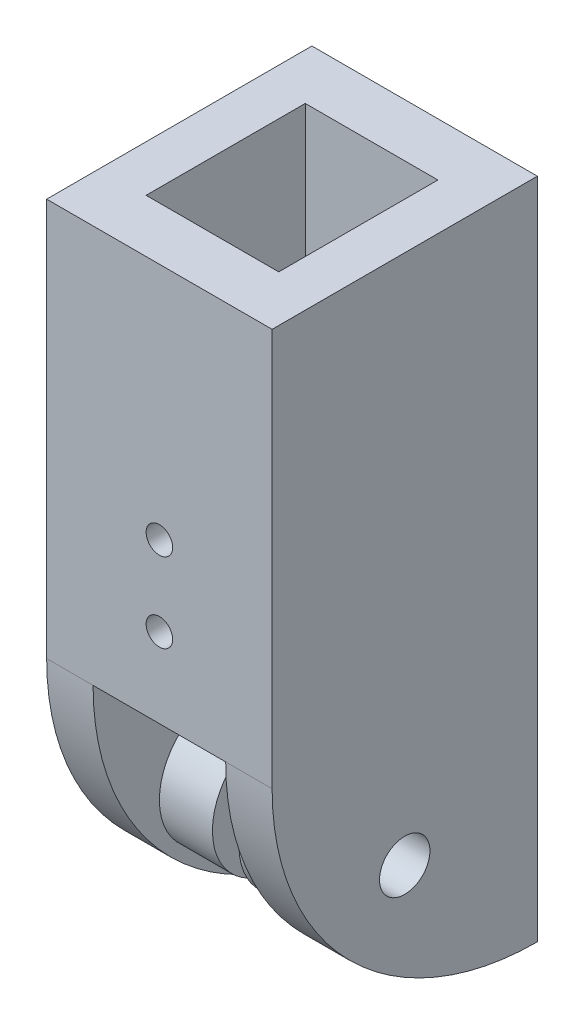
ISO-10303-21;
HEADER;
FILE_DESCRIPTION(('STEP AP214'),'2;1');
FILE_NAME('part.step','',(''),(''),'','','');
FILE_SCHEMA(('AUTOMOTIVE_DESIGN { 1 0 10303 214 1 1 1 1 }'));
ENDSEC;
DATA;
#1=APPLICATION_CONTEXT('core data for automotive mechanical design processes');
#2=APPLICATION_PROTOCOL_DEFINITION('international standard','automotive_design',2000,#1);
#3=PRODUCT_CONTEXT('',#1,'mechanical');
#4=PRODUCT('Part','Part','',(#3));
#5=PRODUCT_RELATED_PRODUCT_CATEGORY('part','',(#4));
#6=PRODUCT_DEFINITION_FORMATION('','',#4);
#7=PRODUCT_DEFINITION_CONTEXT('part definition',#1,'design');
#8=PRODUCT_DEFINITION('design','',#6,#7);
#9=PRODUCT_DEFINITION_SHAPE('','',#8);
#10=(LENGTH_UNIT() NAMED_UNIT(*) SI_UNIT(.MILLI.,.METRE.));
#11=(NAMED_UNIT(*) PLANE_ANGLE_UNIT() SI_UNIT($,.RADIAN.));
#12=(NAMED_UNIT(*) SI_UNIT($,.STERADIAN.) SOLID_ANGLE_UNIT());
#13=UNCERTAINTY_MEASURE_WITH_UNIT(LENGTH_MEASURE(1.E-05),#10,'distance_accuracy_value','');
#14=(GEOMETRIC_REPRESENTATION_CONTEXT(3) GLOBAL_UNCERTAINTY_ASSIGNED_CONTEXT((#13)) GLOBAL_UNIT_ASSIGNED_CONTEXT((#10,
#11,#12)) REPRESENTATION_CONTEXT('',''));
#15=CARTESIAN_POINT('',(0.,0.,0.));
#16=DIRECTION('',(0.,0.,1.));
#17=DIRECTION('',(1.,0.,0.));
#18=AXIS2_PLACEMENT_3D('',#15,#16,#17);
#19=CARTESIAN_POINT('',(2.5,15.,3.));
#20=DIRECTION('',(-1.,0.,0.));
#21=DIRECTION('',(0.,0.,1.));
#22=AXIS2_PLACEMENT_3D('',#19,#20,#21);
#23=PLANE('',#22);
#24=DIRECTION('',(0.,-1.,0.));
#25=VECTOR('',#24,1.);
#26=CARTESIAN_POINT('',(2.5,15.,-3.));
#27=LINE('',#26,#25);
#28=CARTESIAN_POINT('',(2.5,15.,-3.));
#29=VERTEX_POINT('',#28);
#30=CARTESIAN_POINT('',(2.5,0.,-3.));
#31=VERTEX_POINT('',#30);
#32=EDGE_CURVE('E158',#29,#31,#27,.T.);
#33=ORIENTED_EDGE('',*,*,#32,.T.);
#34=DIRECTION('',(0.,0.,-1.));
#35=VECTOR('',#34,1.);
#36=CARTESIAN_POINT('',(2.5,0.,0.));
#37=LINE('',#36,#35);
#38=CARTESIAN_POINT('',(2.5,0.,-5.));
#39=VERTEX_POINT('',#38);
#40=EDGE_CURVE('E50',#31,#39,#37,.T.);
#41=ORIENTED_EDGE('',*,*,#40,.T.);
#42=DIRECTION('',(0.,-1.,0.));
#43=VECTOR('',#42,1.);
#44=CARTESIAN_POINT('',(2.5,0.,-5.));
#45=LINE('',#44,#43);
#46=CARTESIAN_POINT('',(2.5,-10.,-5.));
#47=VERTEX_POINT('',#46);
#48=EDGE_CURVE('E239',#39,#47,#45,.T.);
#49=ORIENTED_EDGE('',*,*,#48,.T.);
#50=CARTESIAN_POINT('',(2.5,0.,-5.));
#51=DIRECTION('',(1.,0.,0.));
#52=DIRECTION('',(0.,0.,-1.));
#53=AXIS2_PLACEMENT_3D('',#50,#51,#52);
#54=CIRCLE('',#53,10.);
#55=CARTESIAN_POINT('',(2.5,0.,5.));
#56=VERTEX_POINT('',#55);
#57=EDGE_CURVE('E235',#56,#47,#54,.T.);
#58=ORIENTED_EDGE('',*,*,#57,.F.);
#59=CARTESIAN_POINT('',(2.5,0.,3.));
#60=VERTEX_POINT('',#59);
#61=EDGE_CURVE('E231',#56,#60,#37,.T.);
#62=ORIENTED_EDGE('',*,*,#61,.T.);
#63=DIRECTION('',(0.,-1.,0.));
#64=VECTOR('',#63,1.);
#65=CARTESIAN_POINT('',(2.5,15.,3.));
#66=LINE('',#65,#64);
#67=CARTESIAN_POINT('',(2.5,15.,3.));
#68=VERTEX_POINT('',#67);
#69=EDGE_CURVE('E264',#68,#60,#66,.T.);
#70=ORIENTED_EDGE('',*,*,#69,.F.);
#71=DIRECTION('',(0.,0.,-1.));
#72=VECTOR('',#71,1.);
#73=CARTESIAN_POINT('',(2.5,15.,3.));
#74=LINE('',#73,#72);
#75=EDGE_CURVE('E250',#68,#29,#74,.T.);
#76=ORIENTED_EDGE('',*,*,#75,.T.);
#77=EDGE_LOOP('',(#33,#41,#49,#58,#62,#70,#76));
#78=FACE_BOUND('',#77,.T.);
#79=CARTESIAN_POINT('',(2.5,-5.,0.));
#80=DIRECTION('',(-1.,0.,0.));
#81=DIRECTION('',(0.,0.,1.));
#82=AXIS2_PLACEMENT_3D('',#79,#80,#81);
#83=CIRCLE('',#82,2.5);
#84=CARTESIAN_POINT('',(2.5,-5.,2.5));
#85=VERTEX_POINT('',#84);
#86=EDGE_CURVE('E424',#85,#85,#83,.T.);
#87=ORIENTED_EDGE('',*,*,#86,.F.);
#88=EDGE_LOOP('',(#87));
#89=FACE_BOUND('',#88,.T.);
#90=ADVANCED_FACE('F41',(#78,#89),#23,.T.);
#91=CARTESIAN_POINT('',(-2.5,15.,3.));
#92=DIRECTION('',(1.,0.,0.));
#93=DIRECTION('',(0.,0.,-1.));
#94=AXIS2_PLACEMENT_3D('',#91,#92,#93);
#95=PLANE('',#94);
#96=CARTESIAN_POINT('',(-2.5,-5.,0.));
#97=DIRECTION('',(1.,0.,0.));
#98=DIRECTION('',(0.,0.,-1.));
#99=AXIS2_PLACEMENT_3D('',#96,#97,#98);
#100=CIRCLE('',#99,2.5);
#101=CARTESIAN_POINT('',(-2.5,-5.,-2.5));
#102=VERTEX_POINT('',#101);
#103=EDGE_CURVE('E11',#102,#102,#100,.T.);
#104=ORIENTED_EDGE('',*,*,#103,.F.);
#105=EDGE_LOOP('',(#104));
#106=FACE_BOUND('',#105,.T.);
#107=DIRECTION('',(0.,-1.,0.));
#108=VECTOR('',#107,1.);
#109=CARTESIAN_POINT('',(-2.5,15.,3.));
#110=LINE('',#109,#108);
#111=CARTESIAN_POINT('',(-2.5,15.,3.));
#112=VERTEX_POINT('',#111);
#113=CARTESIAN_POINT('',(-2.5,0.,3.));
#114=VERTEX_POINT('',#113);
#115=EDGE_CURVE('E273',#112,#114,#110,.T.);
#116=ORIENTED_EDGE('',*,*,#115,.T.);
#117=DIRECTION('',(0.,0.,-1.));
#118=VECTOR('',#117,1.);
#119=CARTESIAN_POINT('',(-2.5,0.,0.));
#120=LINE('',#119,#118);
#121=CARTESIAN_POINT('',(-2.5,0.,5.));
#122=VERTEX_POINT('',#121);
#123=EDGE_CURVE('E219',#122,#114,#120,.T.);
#124=ORIENTED_EDGE('',*,*,#123,.F.);
#125=CARTESIAN_POINT('',(-2.5,0.,-5.));
#126=DIRECTION('',(1.,0.,0.));
#127=DIRECTION('',(0.,0.,-1.));
#128=AXIS2_PLACEMENT_3D('',#125,#126,#127);
#129=CIRCLE('',#128,10.);
#130=CARTESIAN_POINT('',(-2.5,-10.,-5.));
#131=VERTEX_POINT('',#130);
#132=EDGE_CURVE('E226',#122,#131,#129,.T.);
#133=ORIENTED_EDGE('',*,*,#132,.T.);
#134=DIRECTION('',(0.,-1.,0.));
#135=VECTOR('',#134,1.);
#136=CARTESIAN_POINT('',(-2.5,0.,-5.));
#137=LINE('',#136,#135);
#138=CARTESIAN_POINT('',(-2.5,0.,-5.));
#139=VERTEX_POINT('',#138);
#140=EDGE_CURVE('E223',#139,#131,#137,.T.);
#141=ORIENTED_EDGE('',*,*,#140,.F.);
#142=CARTESIAN_POINT('',(-2.5,0.,-3.));
#143=VERTEX_POINT('',#142);
#144=EDGE_CURVE('E218',#143,#139,#120,.T.);
#145=ORIENTED_EDGE('',*,*,#144,.F.);
#146=DIRECTION('',(0.,-1.,0.));
#147=VECTOR('',#146,1.);
#148=CARTESIAN_POINT('',(-2.5,15.,-3.));
#149=LINE('',#148,#147);
#150=CARTESIAN_POINT('',(-2.5,15.,-3.));
#151=VERTEX_POINT('',#150);
#152=EDGE_CURVE('E276',#151,#143,#149,.T.);
#153=ORIENTED_EDGE('',*,*,#152,.F.);
#154=DIRECTION('',(0.,0.,1.));
#155=VECTOR('',#154,1.);
#156=CARTESIAN_POINT('',(-2.5,15.,3.));
#157=LINE('',#156,#155);
#158=EDGE_CURVE('E257',#151,#112,#157,.T.);
#159=ORIENTED_EDGE('',*,*,#158,.T.);
#160=EDGE_LOOP('',(#116,#124,#133,#141,#145,#153,#159));
#161=FACE_BOUND('',#160,.T.);
#162=ADVANCED_FACE('F295',(#106,#161),#95,.T.);
#163=CARTESIAN_POINT('',(0.,0.,0.));
#164=DIRECTION('',(0.,-1.,0.));
#165=DIRECTION('',(0.,0.,-1.));
#166=AXIS2_PLACEMENT_3D('',#163,#164,#165);
#167=PLANE('',#166);
#168=DIRECTION('',(1.,0.,0.));
#169=VECTOR('',#168,1.);
#170=CARTESIAN_POINT('',(-4.5,0.,5.));
#171=LINE('',#170,#169);
#172=EDGE_CURVE('E155',#122,#56,#171,.T.);
#173=ORIENTED_EDGE('',*,*,#172,.F.);
#174=ORIENTED_EDGE('',*,*,#123,.T.);
#175=DIRECTION('',(1.,0.,0.));
#176=VECTOR('',#175,1.);
#177=CARTESIAN_POINT('',(-2.5,0.,3.));
#178=LINE('',#177,#176);
#179=EDGE_CURVE('E254',#114,#60,#178,.T.);
#180=ORIENTED_EDGE('',*,*,#179,.T.);
#181=ORIENTED_EDGE('',*,*,#61,.F.);
#182=EDGE_LOOP('',(#173,#174,#180,#181));
#183=FACE_BOUND('',#182,.T.);
#184=ADVANCED_FACE('F314',(#183),#167,.T.);
#185=DIRECTION('',(-1.,0.,0.));
#186=VECTOR('',#185,1.);
#187=CARTESIAN_POINT('',(-2.5,0.,-3.));
#188=LINE('',#187,#186);
#189=EDGE_CURVE('E247',#31,#143,#188,.T.);
#190=ORIENTED_EDGE('',*,*,#189,.T.);
#191=ORIENTED_EDGE('',*,*,#144,.T.);
#192=DIRECTION('',(-1.,0.,0.));
#193=VECTOR('',#192,1.);
#194=CARTESIAN_POINT('',(-4.5,0.,-5.));
#195=LINE('',#194,#193);
#196=EDGE_CURVE('E161',#39,#139,#195,.T.);
#197=ORIENTED_EDGE('',*,*,#196,.F.);
#198=ORIENTED_EDGE('',*,*,#40,.F.);
#199=EDGE_LOOP('',(#190,#191,#197,#198));
#200=FACE_BOUND('',#199,.T.);
#201=ADVANCED_FACE('F301',(#200),#167,.T.);
#202=CARTESIAN_POINT('',(0.,15.,0.));
#203=DIRECTION('',(0.,-1.,0.));
#204=DIRECTION('',(0.,0.,-1.));
#205=AXIS2_PLACEMENT_3D('',#202,#203,#204);
#206=PLANE('',#205);
#207=DIRECTION('',(-1.,0.,0.));
#208=VECTOR('',#207,1.);
#209=CARTESIAN_POINT('',(-4.5,15.,-5.));
#210=LINE('',#209,#208);
#211=CARTESIAN_POINT('',(4.25,15.,-5.));
#212=VERTEX_POINT('',#211);
#213=CARTESIAN_POINT('',(-4.25,15.,-5.));
#214=VERTEX_POINT('',#213);
#215=EDGE_CURVE('E138',#212,#214,#210,.T.);
#216=ORIENTED_EDGE('',*,*,#215,.T.);
#217=DIRECTION('',(0.,0.,1.));
#218=VECTOR('',#217,1.);
#219=CARTESIAN_POINT('',(-4.25,15.,-5.));
#220=LINE('',#219,#218);
#221=CARTESIAN_POINT('',(-4.25,15.,5.));
#222=VERTEX_POINT('',#221);
#223=EDGE_CURVE('E123',#214,#222,#220,.T.);
#224=ORIENTED_EDGE('',*,*,#223,.T.);
#225=DIRECTION('',(1.,0.,0.));
#226=VECTOR('',#225,1.);
#227=CARTESIAN_POINT('',(-4.5,15.,5.));
#228=LINE('',#227,#226);
#229=CARTESIAN_POINT('',(4.25,15.,5.));
#230=VERTEX_POINT('',#229);
#231=EDGE_CURVE('E149',#222,#230,#228,.T.);
#232=ORIENTED_EDGE('',*,*,#231,.T.);
#233=DIRECTION('',(0.,0.,1.));
#234=VECTOR('',#233,1.);
#235=CARTESIAN_POINT('',(4.25,15.,-5.));
#236=LINE('',#235,#234);
#237=EDGE_CURVE('E143',#212,#230,#236,.T.);
#238=ORIENTED_EDGE('',*,*,#237,.F.);
#239=EDGE_LOOP('',(#216,#224,#232,#238));
#240=FACE_BOUND('',#239,.T.);
#241=ORIENTED_EDGE('',*,*,#75,.F.);
#242=DIRECTION('',(1.,0.,0.));
#243=VECTOR('',#242,1.);
#244=CARTESIAN_POINT('',(-2.5,15.,3.));
#245=LINE('',#244,#243);
#246=EDGE_CURVE('E261',#112,#68,#245,.T.);
#247=ORIENTED_EDGE('',*,*,#246,.F.);
#248=ORIENTED_EDGE('',*,*,#158,.F.);
#249=DIRECTION('',(-1.,0.,0.));
#250=VECTOR('',#249,1.);
#251=CARTESIAN_POINT('',(-2.5,15.,-3.));
#252=LINE('',#251,#250);
#253=EDGE_CURVE('E253',#29,#151,#252,.T.);
#254=ORIENTED_EDGE('',*,*,#253,.F.);
#255=EDGE_LOOP('',(#241,#247,#248,#254));
#256=FACE_BOUND('',#255,.T.);
#257=ADVANCED_FACE('F146',(#240,#256),#206,.F.);
#258=CARTESIAN_POINT('',(-4.5,15.,-5.));
#259=DIRECTION('',(0.,0.,1.));
#260=DIRECTION('',(1.,0.,0.));
#261=AXIS2_PLACEMENT_3D('',#258,#259,#260);
#262=PLANE('',#261);
#263=CARTESIAN_POINT('',(0.,3.,-5.));
#264=DIRECTION('',(0.,0.,1.));
#265=DIRECTION('',(1.,0.,0.));
#266=AXIS2_PLACEMENT_3D('',#263,#264,#265);
#267=CIRCLE('',#266,0.5);
#268=CARTESIAN_POINT('',(0.5,3.,-5.));
#269=VERTEX_POINT('',#268);
#270=EDGE_CURVE('E170',#269,#269,#267,.T.);
#271=ORIENTED_EDGE('',*,*,#270,.T.);
#272=EDGE_LOOP('',(#271));
#273=FACE_BOUND('',#272,.T.);
#274=CARTESIAN_POINT('',(0.,6.,-5.));
#275=DIRECTION('',(0.,0.,1.));
#276=DIRECTION('',(1.,0.,0.));
#277=AXIS2_PLACEMENT_3D('',#274,#275,#276);
#278=CIRCLE('',#277,0.5);
#279=CARTESIAN_POINT('',(0.5,6.,-5.));
#280=VERTEX_POINT('',#279);
#281=EDGE_CURVE('E205',#280,#280,#278,.T.);
#282=ORIENTED_EDGE('',*,*,#281,.T.);
#283=EDGE_LOOP('',(#282));
#284=FACE_BOUND('',#283,.T.);
#285=DIRECTION('',(-1.,0.,0.));
#286=VECTOR('',#285,1.);
#287=CARTESIAN_POINT('',(-2.5,-10.,-5.));
#288=LINE('',#287,#286);
#289=CARTESIAN_POINT('',(-4.25,-10.,-5.));
#290=VERTEX_POINT('',#289);
#291=EDGE_CURVE('E141',#131,#290,#288,.T.);
#292=ORIENTED_EDGE('',*,*,#291,.T.);
#293=DIRECTION('',(0.,1.,0.));
#294=VECTOR('',#293,1.);
#295=CARTESIAN_POINT('',(-4.25,15.,-5.));
#296=LINE('',#295,#294);
#297=EDGE_CURVE('E65',#290,#214,#296,.T.);
#298=ORIENTED_EDGE('',*,*,#297,.T.);
#299=ORIENTED_EDGE('',*,*,#215,.F.);
#300=DIRECTION('',(0.,-1.,0.));
#301=VECTOR('',#300,1.);
#302=CARTESIAN_POINT('',(4.25,15.,-5.));
#303=LINE('',#302,#301);
#304=CARTESIAN_POINT('',(4.25,-10.,-5.));
#305=VERTEX_POINT('',#304);
#306=EDGE_CURVE('E432',#212,#305,#303,.T.);
#307=ORIENTED_EDGE('',*,*,#306,.T.);
#308=DIRECTION('',(1.,0.,0.));
#309=VECTOR('',#308,1.);
#310=CARTESIAN_POINT('',(2.5,-10.,-5.));
#311=LINE('',#310,#309);
#312=EDGE_CURVE('E243',#47,#305,#311,.T.);
#313=ORIENTED_EDGE('',*,*,#312,.F.);
#314=ORIENTED_EDGE('',*,*,#48,.F.);
#315=ORIENTED_EDGE('',*,*,#196,.T.);
#316=ORIENTED_EDGE('',*,*,#140,.T.);
#317=EDGE_LOOP('',(#292,#298,#299,#307,#313,#314,#315,#316));
#318=FACE_BOUND('',#317,.T.);
#319=ADVANCED_FACE('F43',(#273,#284,#318),#262,.F.);
#320=CARTESIAN_POINT('',(-4.5,15.,5.));
#321=DIRECTION('',(0.,0.,-1.));
#322=DIRECTION('',(-1.,0.,0.));
#323=AXIS2_PLACEMENT_3D('',#320,#321,#322);
#324=PLANE('',#323);
#325=CARTESIAN_POINT('',(0.,3.,5.));
#326=DIRECTION('',(0.,0.,1.));
#327=DIRECTION('',(1.,0.,0.));
#328=AXIS2_PLACEMENT_3D('',#325,#326,#327);
#329=CIRCLE('',#328,0.5);
#330=CARTESIAN_POINT('',(0.5,3.,5.));
#331=VERTEX_POINT('',#330);
#332=EDGE_CURVE('E201',#331,#331,#329,.T.);
#333=ORIENTED_EDGE('',*,*,#332,.F.);
#334=EDGE_LOOP('',(#333));
#335=FACE_BOUND('',#334,.T.);
#336=CARTESIAN_POINT('',(0.,6.,5.));
#337=DIRECTION('',(0.,0.,1.));
#338=DIRECTION('',(1.,0.,0.));
#339=AXIS2_PLACEMENT_3D('',#336,#337,#338);
#340=CIRCLE('',#339,0.5);
#341=CARTESIAN_POINT('',(0.5,6.,5.));
#342=VERTEX_POINT('',#341);
#343=EDGE_CURVE('E197',#342,#342,#340,.T.);
#344=ORIENTED_EDGE('',*,*,#343,.F.);
#345=EDGE_LOOP('',(#344));
#346=FACE_BOUND('',#345,.T.);
#347=ORIENTED_EDGE('',*,*,#231,.F.);
#348=DIRECTION('',(0.,-1.,0.));
#349=VECTOR('',#348,1.);
#350=CARTESIAN_POINT('',(-4.25,15.,5.));
#351=LINE('',#350,#349);
#352=CARTESIAN_POINT('',(-4.25,0.,5.));
#353=VERTEX_POINT('',#352);
#354=EDGE_CURVE('E126',#222,#353,#351,.T.);
#355=ORIENTED_EDGE('',*,*,#354,.T.);
#356=EDGE_CURVE('E150',#353,#122,#171,.T.);
#357=ORIENTED_EDGE('',*,*,#356,.T.);
#358=ORIENTED_EDGE('',*,*,#172,.T.);
#359=DIRECTION('',(1.,0.,0.));
#360=VECTOR('',#359,1.);
#361=CARTESIAN_POINT('',(2.5,0.,5.));
#362=LINE('',#361,#360);
#363=CARTESIAN_POINT('',(4.25,0.,5.));
#364=VERTEX_POINT('',#363);
#365=EDGE_CURVE('E242',#56,#364,#362,.T.);
#366=ORIENTED_EDGE('',*,*,#365,.T.);
#367=DIRECTION('',(0.,1.,0.));
#368=VECTOR('',#367,1.);
#369=CARTESIAN_POINT('',(4.25,15.,5.));
#370=LINE('',#369,#368);
#371=EDGE_CURVE('E57',#364,#230,#370,.T.);
#372=ORIENTED_EDGE('',*,*,#371,.T.);
#373=EDGE_LOOP('',(#347,#355,#357,#358,#366,#372));
#374=FACE_BOUND('',#373,.T.);
#375=ADVANCED_FACE('F308',(#335,#346,#374),#324,.F.);
#376=CARTESIAN_POINT('',(-2.5,15.,-3.));
#377=DIRECTION('',(0.,0.,1.));
#378=DIRECTION('',(1.,0.,0.));
#379=AXIS2_PLACEMENT_3D('',#376,#377,#378);
#380=PLANE('',#379);
#381=CARTESIAN_POINT('',(0.,3.,-3.));
#382=DIRECTION('',(0.,0.,1.));
#383=DIRECTION('',(1.,0.,0.));
#384=AXIS2_PLACEMENT_3D('',#381,#382,#383);
#385=CIRCLE('',#384,0.5);
#386=CARTESIAN_POINT('',(0.5,3.,-3.));
#387=VERTEX_POINT('',#386);
#388=EDGE_CURVE('E175',#387,#387,#385,.T.);
#389=ORIENTED_EDGE('',*,*,#388,.F.);
#390=EDGE_LOOP('',(#389));
#391=FACE_BOUND('',#390,.T.);
#392=CARTESIAN_POINT('',(0.,6.,-3.));
#393=DIRECTION('',(0.,0.,1.));
#394=DIRECTION('',(1.,0.,0.));
#395=AXIS2_PLACEMENT_3D('',#392,#393,#394);
#396=CIRCLE('',#395,0.5);
#397=CARTESIAN_POINT('',(0.5,6.,-3.));
#398=VERTEX_POINT('',#397);
#399=EDGE_CURVE('E169',#398,#398,#396,.T.);
#400=ORIENTED_EDGE('',*,*,#399,.F.);
#401=EDGE_LOOP('',(#400));
#402=FACE_BOUND('',#401,.T.);
#403=ORIENTED_EDGE('',*,*,#189,.F.);
#404=ORIENTED_EDGE('',*,*,#32,.F.);
#405=ORIENTED_EDGE('',*,*,#253,.T.);
#406=ORIENTED_EDGE('',*,*,#152,.T.);
#407=EDGE_LOOP('',(#403,#404,#405,#406));
#408=FACE_BOUND('',#407,.T.);
#409=ADVANCED_FACE('F291',(#391,#402,#408),#380,.T.);
#410=CARTESIAN_POINT('',(-2.5,15.,3.));
#411=DIRECTION('',(0.,0.,-1.));
#412=DIRECTION('',(-1.,0.,0.));
#413=AXIS2_PLACEMENT_3D('',#410,#411,#412);
#414=PLANE('',#413);
#415=CARTESIAN_POINT('',(0.,3.,3.));
#416=DIRECTION('',(0.,0.,-1.));
#417=DIRECTION('',(-1.,0.,0.));
#418=AXIS2_PLACEMENT_3D('',#415,#416,#417);
#419=CIRCLE('',#418,0.5);
#420=CARTESIAN_POINT('',(-0.5,3.,3.));
#421=VERTEX_POINT('',#420);
#422=EDGE_CURVE('E171',#421,#421,#419,.T.);
#423=ORIENTED_EDGE('',*,*,#422,.F.);
#424=EDGE_LOOP('',(#423));
#425=FACE_BOUND('',#424,.T.);
#426=CARTESIAN_POINT('',(0.,6.,3.));
#427=DIRECTION('',(0.,0.,-1.));
#428=DIRECTION('',(-1.,0.,0.));
#429=AXIS2_PLACEMENT_3D('',#426,#427,#428);
#430=CIRCLE('',#429,0.5);
#431=CARTESIAN_POINT('',(-0.5,6.,3.));
#432=VERTEX_POINT('',#431);
#433=EDGE_CURVE('E165',#432,#432,#430,.T.);
#434=ORIENTED_EDGE('',*,*,#433,.F.);
#435=EDGE_LOOP('',(#434));
#436=FACE_BOUND('',#435,.T.);
#437=ORIENTED_EDGE('',*,*,#179,.F.);
#438=ORIENTED_EDGE('',*,*,#115,.F.);
#439=ORIENTED_EDGE('',*,*,#246,.T.);
#440=ORIENTED_EDGE('',*,*,#69,.T.);
#441=EDGE_LOOP('',(#437,#438,#439,#440));
#442=FACE_BOUND('',#441,.T.);
#443=ADVANCED_FACE('F316',(#425,#436,#442),#414,.T.);
#444=CARTESIAN_POINT('',(2.5,0.,-5.));
#445=DIRECTION('',(1.,0.,0.));
#446=DIRECTION('',(0.,0.,-1.));
#447=AXIS2_PLACEMENT_3D('',#444,#445,#446);
#448=CYLINDRICAL_SURFACE('',#447,10.);
#449=CARTESIAN_POINT('',(4.25,0.,-5.));
#450=DIRECTION('',(-1.,0.,0.));
#451=DIRECTION('',(0.,-1.,0.));
#452=AXIS2_PLACEMENT_3D('',#449,#450,#451);
#453=CIRCLE('',#452,10.);
#454=EDGE_CURVE('E178',#364,#305,#453,.F.);
#455=ORIENTED_EDGE('',*,*,#454,.F.);
#456=ORIENTED_EDGE('',*,*,#365,.F.);
#457=ORIENTED_EDGE('',*,*,#57,.T.);
#458=ORIENTED_EDGE('',*,*,#312,.T.);
#459=EDGE_LOOP('',(#455,#456,#457,#458));
#460=FACE_BOUND('',#459,.T.);
#461=ADVANCED_FACE('F307',(#460),#448,.T.);
#462=CARTESIAN_POINT('',(-2.5,0.,-5.));
#463=DIRECTION('',(-1.,0.,0.));
#464=DIRECTION('',(0.,0.,1.));
#465=AXIS2_PLACEMENT_3D('',#462,#463,#464);
#466=CYLINDRICAL_SURFACE('',#465,10.);
#467=ORIENTED_EDGE('',*,*,#356,.F.);
#468=CARTESIAN_POINT('',(-4.25,0.,-5.));
#469=DIRECTION('',(1.,0.,0.));
#470=DIRECTION('',(0.,1.,0.));
#471=AXIS2_PLACEMENT_3D('',#468,#469,#470);
#472=CIRCLE('',#471,10.);
#473=EDGE_CURVE('E182',#353,#290,#472,.T.);
#474=ORIENTED_EDGE('',*,*,#473,.T.);
#475=ORIENTED_EDGE('',*,*,#291,.F.);
#476=ORIENTED_EDGE('',*,*,#132,.F.);
#477=EDGE_LOOP('',(#467,#474,#475,#476));
#478=FACE_BOUND('',#477,.T.);
#479=ADVANCED_FACE('F325',(#478),#466,.T.);
#480=CARTESIAN_POINT('',(6.74264068711928,-5.,0.));
#481=DIRECTION('',(-1.,0.,0.));
#482=DIRECTION('',(0.,0.,1.));
#483=AXIS2_PLACEMENT_3D('',#480,#481,#482);
#484=CYLINDRICAL_SURFACE('',#483,1.5);
#485=CARTESIAN_POINT('',(-0.499999999999996,-5.,0.));
#486=DIRECTION('',(-1.,0.,0.));
#487=DIRECTION('',(0.,0.,1.));
#488=AXIS2_PLACEMENT_3D('',#485,#486,#487);
#489=CIRCLE('',#488,1.5);
#490=CARTESIAN_POINT('',(-0.499999999999996,-5.,1.5));
#491=VERTEX_POINT('',#490);
#492=EDGE_CURVE('E414',#491,#491,#489,.T.);
#493=ORIENTED_EDGE('',*,*,#492,.F.);
#494=EDGE_LOOP('',(#493));
#495=FACE_BOUND('',#494,.T.);
#496=CARTESIAN_POINT('',(0.499999999999996,-5.,0.));
#497=DIRECTION('',(-1.,0.,0.));
#498=DIRECTION('',(0.,0.,1.));
#499=AXIS2_PLACEMENT_3D('',#496,#497,#498);
#500=CIRCLE('',#499,1.5);
#501=CARTESIAN_POINT('',(0.499999999999996,-5.,1.5));
#502=VERTEX_POINT('',#501);
#503=EDGE_CURVE('E419',#502,#502,#500,.T.);
#504=ORIENTED_EDGE('',*,*,#503,.T.);
#505=EDGE_LOOP('',(#504));
#506=FACE_BOUND('',#505,.T.);
#507=ADVANCED_FACE('F357',(#495,#506),#484,.T.);
#508=CARTESIAN_POINT('',(0.,6.,-5.));
#509=DIRECTION('',(0.,0.,1.));
#510=DIRECTION('',(1.,0.,0.));
#511=AXIS2_PLACEMENT_3D('',#508,#509,#510);
#512=CYLINDRICAL_SURFACE('',#511,0.5);
#513=ORIENTED_EDGE('',*,*,#433,.T.);
#514=EDGE_LOOP('',(#513));
#515=FACE_BOUND('',#514,.T.);
#516=ORIENTED_EDGE('',*,*,#343,.T.);
#517=EDGE_LOOP('',(#516));
#518=FACE_BOUND('',#517,.T.);
#519=ADVANCED_FACE('F354',(#515,#518),#512,.F.);
#520=CARTESIAN_POINT('',(0.,3.,-5.));
#521=DIRECTION('',(0.,0.,1.));
#522=DIRECTION('',(1.,0.,0.));
#523=AXIS2_PLACEMENT_3D('',#520,#521,#522);
#524=CYLINDRICAL_SURFACE('',#523,0.5);
#525=ORIENTED_EDGE('',*,*,#422,.T.);
#526=EDGE_LOOP('',(#525));
#527=FACE_BOUND('',#526,.T.);
#528=ORIENTED_EDGE('',*,*,#332,.T.);
#529=EDGE_LOOP('',(#528));
#530=FACE_BOUND('',#529,.T.);
#531=ADVANCED_FACE('F356',(#527,#530),#524,.F.);
#532=ORIENTED_EDGE('',*,*,#399,.T.);
#533=EDGE_LOOP('',(#532));
#534=FACE_BOUND('',#533,.T.);
#535=ORIENTED_EDGE('',*,*,#281,.F.);
#536=EDGE_LOOP('',(#535));
#537=FACE_BOUND('',#536,.T.);
#538=ADVANCED_FACE('F360',(#534,#537),#512,.F.);
#539=ORIENTED_EDGE('',*,*,#388,.T.);
#540=EDGE_LOOP('',(#539));
#541=FACE_BOUND('',#540,.T.);
#542=ORIENTED_EDGE('',*,*,#270,.F.);
#543=EDGE_LOOP('',(#542));
#544=FACE_BOUND('',#543,.T.);
#545=ADVANCED_FACE('F367',(#541,#544),#524,.F.);
#546=CARTESIAN_POINT('',(4.25,15.,-5.));
#547=DIRECTION('',(-1.,0.,0.));
#548=DIRECTION('',(0.,-1.,0.));
#549=AXIS2_PLACEMENT_3D('',#546,#547,#548);
#550=PLANE('',#549);
#551=CARTESIAN_POINT('',(4.25,-5.,0.));
#552=DIRECTION('',(-1.,0.,0.));
#553=DIRECTION('',(0.,-1.,0.));
#554=AXIS2_PLACEMENT_3D('',#551,#552,#553);
#555=CIRCLE('',#554,0.95);
#556=CARTESIAN_POINT('',(4.25,-5.95,0.));
#557=VERTEX_POINT('',#556);
#558=EDGE_CURVE('E132',#557,#557,#555,.F.);
#559=ORIENTED_EDGE('',*,*,#558,.F.);
#560=EDGE_LOOP('',(#559));
#561=FACE_BOUND('',#560,.T.);
#562=ORIENTED_EDGE('',*,*,#454,.T.);
#563=ORIENTED_EDGE('',*,*,#306,.F.);
#564=ORIENTED_EDGE('',*,*,#237,.T.);
#565=ORIENTED_EDGE('',*,*,#371,.F.);
#566=EDGE_LOOP('',(#562,#563,#564,#565));
#567=FACE_BOUND('',#566,.T.);
#568=ADVANCED_FACE('F376',(#561,#567),#550,.F.);
#569=CARTESIAN_POINT('',(-4.25,15.,-5.));
#570=DIRECTION('',(1.,0.,0.));
#571=DIRECTION('',(0.,1.,0.));
#572=AXIS2_PLACEMENT_3D('',#569,#570,#571);
#573=PLANE('',#572);
#574=CARTESIAN_POINT('',(-4.25,-5.,0.));
#575=DIRECTION('',(1.,0.,0.));
#576=DIRECTION('',(0.,1.,0.));
#577=AXIS2_PLACEMENT_3D('',#574,#575,#576);
#578=CIRCLE('',#577,0.95);
#579=CARTESIAN_POINT('',(-4.25,-4.05,0.));
#580=VERTEX_POINT('',#579);
#581=EDGE_CURVE('E179',#580,#580,#578,.F.);
#582=ORIENTED_EDGE('',*,*,#581,.F.);
#583=EDGE_LOOP('',(#582));
#584=FACE_BOUND('',#583,.T.);
#585=ORIENTED_EDGE('',*,*,#223,.F.);
#586=ORIENTED_EDGE('',*,*,#297,.F.);
#587=ORIENTED_EDGE('',*,*,#473,.F.);
#588=ORIENTED_EDGE('',*,*,#354,.F.);
#589=EDGE_LOOP('',(#585,#586,#587,#588));
#590=FACE_BOUND('',#589,.T.);
#591=ADVANCED_FACE('F124',(#584,#590),#573,.F.);
#592=CARTESIAN_POINT('',(-4.5,-5.,0.));
#593=DIRECTION('',(1.,0.,0.));
#594=DIRECTION('',(0.,0.,-1.));
#595=AXIS2_PLACEMENT_3D('',#592,#593,#594);
#596=CYLINDRICAL_SURFACE('',#595,0.95);
#597=ORIENTED_EDGE('',*,*,#581,.T.);
#598=EDGE_LOOP('',(#597));
#599=FACE_BOUND('',#598,.T.);
#600=ORIENTED_EDGE('',*,*,#558,.T.);
#601=EDGE_LOOP('',(#600));
#602=FACE_BOUND('',#601,.T.);
#603=ADVANCED_FACE('F392',(#599,#602),#596,.F.);
#604=CARTESIAN_POINT('',(0.499999999999996,-5.,0.));
#605=DIRECTION('',(-1.,0.,0.));
#606=DIRECTION('',(0.,0.,1.));
#607=AXIS2_PLACEMENT_3D('',#604,#605,#606);
#608=PLANE('',#607);
#609=CARTESIAN_POINT('',(0.499999999999996,-5.,0.));
#610=DIRECTION('',(-1.,0.,0.));
#611=DIRECTION('',(0.,0.,1.));
#612=AXIS2_PLACEMENT_3D('',#609,#610,#611);
#613=CIRCLE('',#612,2.5);
#614=CARTESIAN_POINT('',(0.499999999999996,-5.,2.5));
#615=VERTEX_POINT('',#614);
#616=EDGE_CURVE('E428',#615,#615,#613,.T.);
#617=ORIENTED_EDGE('',*,*,#616,.T.);
#618=EDGE_LOOP('',(#617));
#619=FACE_BOUND('',#618,.T.);
#620=ORIENTED_EDGE('',*,*,#503,.F.);
#621=EDGE_LOOP('',(#620));
#622=FACE_BOUND('',#621,.T.);
#623=ADVANCED_FACE('F398',(#619,#622),#608,.T.);
#624=CARTESIAN_POINT('',(0.499999999999996,-5.,0.));
#625=DIRECTION('',(1.,0.,0.));
#626=DIRECTION('',(0.,0.,-1.));
#627=AXIS2_PLACEMENT_3D('',#624,#625,#626);
#628=CYLINDRICAL_SURFACE('',#627,2.5);
#629=ORIENTED_EDGE('',*,*,#616,.F.);
#630=EDGE_LOOP('',(#629));
#631=FACE_BOUND('',#630,.T.);
#632=ORIENTED_EDGE('',*,*,#86,.T.);
#633=EDGE_LOOP('',(#632));
#634=FACE_BOUND('',#633,.T.);
#635=ADVANCED_FACE('F394',(#631,#634),#628,.T.);
#636=CARTESIAN_POINT('',(-0.499999999999996,-5.,0.));
#637=DIRECTION('',(-1.,0.,0.));
#638=DIRECTION('',(0.,0.,1.));
#639=AXIS2_PLACEMENT_3D('',#636,#637,#638);
#640=CYLINDRICAL_SURFACE('',#639,2.5);
#641=CARTESIAN_POINT('',(-0.499999999999996,-5.,0.));
#642=DIRECTION('',(-1.,0.,0.));
#643=DIRECTION('',(0.,0.,1.));
#644=AXIS2_PLACEMENT_3D('',#641,#642,#643);
#645=CIRCLE('',#644,2.5);
#646=CARTESIAN_POINT('',(-0.499999999999996,-5.,2.5));
#647=VERTEX_POINT('',#646);
#648=EDGE_CURVE('E417',#647,#647,#645,.T.);
#649=ORIENTED_EDGE('',*,*,#648,.T.);
#650=EDGE_LOOP('',(#649));
#651=FACE_BOUND('',#650,.T.);
#652=ORIENTED_EDGE('',*,*,#103,.T.);
#653=EDGE_LOOP('',(#652));
#654=FACE_BOUND('',#653,.T.);
#655=ADVANCED_FACE('F397',(#651,#654),#640,.T.);
#656=CARTESIAN_POINT('',(-0.499999999999996,-5.,0.));
#657=DIRECTION('',(1.,0.,0.));
#658=DIRECTION('',(0.,0.,1.));
#659=AXIS2_PLACEMENT_3D('',#656,#657,#658);
#660=PLANE('',#659);
#661=ORIENTED_EDGE('',*,*,#492,.T.);
#662=EDGE_LOOP('',(#661));
#663=FACE_BOUND('',#662,.T.);
#664=ORIENTED_EDGE('',*,*,#648,.F.);
#665=EDGE_LOOP('',(#664));
#666=FACE_BOUND('',#665,.T.);
#667=ADVANCED_FACE('F405',(#663,#666),#660,.T.);
#668=CLOSED_SHELL('',(#90,#162,#184,#201,#257,#319,#375,#409,#443,#461,#479,#507,#519,#531,#538,
#545,#568,#591,#603,#623,#635,#655,#667));
#669=MANIFOLD_SOLID_BREP('B2',#668);
#670=ADVANCED_BREP_SHAPE_REPRESENTATION('',(#18,#669),#14);
#671=SHAPE_DEFINITION_REPRESENTATION(#9,#670);
ENDSEC;
END-ISO-10303-21;
